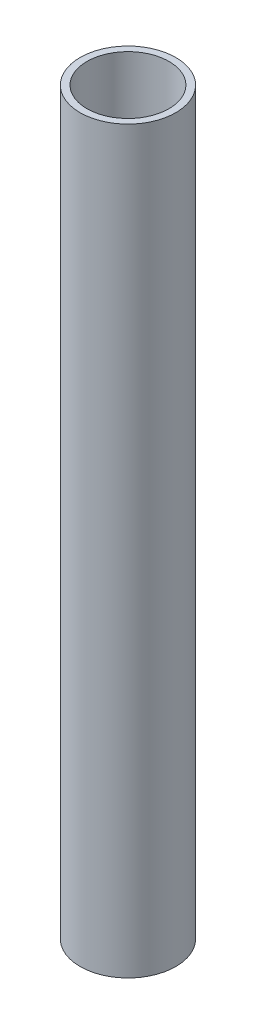
ISO-10303-21;
HEADER;
FILE_DESCRIPTION(('STEP AP214'),'2;1');
FILE_NAME('part.step','',(''),(''),'','','');
FILE_SCHEMA(('AUTOMOTIVE_DESIGN { 1 0 10303 214 1 1 1 1 }'));
ENDSEC;
DATA;
#1=APPLICATION_CONTEXT('core data for automotive mechanical design processes');
#2=APPLICATION_PROTOCOL_DEFINITION('international standard','automotive_design',2000,#1);
#3=PRODUCT_CONTEXT('',#1,'mechanical');
#4=PRODUCT('Part','Part','',(#3));
#5=PRODUCT_RELATED_PRODUCT_CATEGORY('part','',(#4));
#6=PRODUCT_DEFINITION_FORMATION('','',#4);
#7=PRODUCT_DEFINITION_CONTEXT('part definition',#1,'design');
#8=PRODUCT_DEFINITION('design','',#6,#7);
#9=PRODUCT_DEFINITION_SHAPE('','',#8);
#10=(LENGTH_UNIT() NAMED_UNIT(*) SI_UNIT(.MILLI.,.METRE.));
#11=(NAMED_UNIT(*) PLANE_ANGLE_UNIT() SI_UNIT($,.RADIAN.));
#12=(NAMED_UNIT(*) SI_UNIT($,.STERADIAN.) SOLID_ANGLE_UNIT());
#13=UNCERTAINTY_MEASURE_WITH_UNIT(LENGTH_MEASURE(1.E-05),#10,'distance_accuracy_value','');
#14=(GEOMETRIC_REPRESENTATION_CONTEXT(3) GLOBAL_UNCERTAINTY_ASSIGNED_CONTEXT((#13)) GLOBAL_UNIT_ASSIGNED_CONTEXT((#10,
#11,#12)) REPRESENTATION_CONTEXT('',''));
#15=CARTESIAN_POINT('',(0.,0.,0.));
#16=DIRECTION('',(0.,0.,1.));
#17=DIRECTION('',(1.,0.,0.));
#18=AXIS2_PLACEMENT_3D('',#15,#16,#17);
#19=CARTESIAN_POINT('',(0.,216.,0.));
#20=DIRECTION('',(0.,1.,0.));
#21=DIRECTION('',(0.,0.,1.));
#22=AXIS2_PLACEMENT_3D('',#19,#20,#21);
#23=PLANE('',#22);
#24=CARTESIAN_POINT('',(0.,216.,0.));
#25=DIRECTION('',(0.,1.,0.));
#26=DIRECTION('',(0.,0.,1.));
#27=AXIS2_PLACEMENT_3D('',#24,#25,#26);
#28=CIRCLE('',#27,13.975);
#29=CARTESIAN_POINT('',(0.,216.,13.975));
#30=VERTEX_POINT('',#29);
#31=EDGE_CURVE('E11',#30,#30,#28,.T.);
#32=ORIENTED_EDGE('',*,*,#31,.T.);
#33=EDGE_LOOP('',(#32));
#34=FACE_BOUND('',#33,.T.);
#35=CARTESIAN_POINT('',(0.,216.,0.));
#36=DIRECTION('',(0.,1.,0.));
#37=DIRECTION('',(0.,0.,1.));
#38=AXIS2_PLACEMENT_3D('',#35,#36,#37);
#39=CIRCLE('',#38,11.975);
#40=CARTESIAN_POINT('',(0.,216.,11.975));
#41=VERTEX_POINT('',#40);
#42=EDGE_CURVE('E49',#41,#41,#39,.T.);
#43=ORIENTED_EDGE('',*,*,#42,.F.);
#44=EDGE_LOOP('',(#43));
#45=FACE_BOUND('',#44,.T.);
#46=ADVANCED_FACE('F38',(#34,#45),#23,.T.);
#47=CARTESIAN_POINT('',(0.,0.,0.));
#48=DIRECTION('',(0.,1.,0.));
#49=DIRECTION('',(0.,0.,1.));
#50=AXIS2_PLACEMENT_3D('',#47,#48,#49);
#51=PLANE('',#50);
#52=CARTESIAN_POINT('',(0.,0.,0.));
#53=DIRECTION('',(0.,1.,0.));
#54=DIRECTION('',(0.,0.,1.));
#55=AXIS2_PLACEMENT_3D('',#52,#53,#54);
#56=CIRCLE('',#55,13.975);
#57=CARTESIAN_POINT('',(0.,0.,13.975));
#58=VERTEX_POINT('',#57);
#59=EDGE_CURVE('E42',#58,#58,#56,.T.);
#60=ORIENTED_EDGE('',*,*,#59,.F.);
#61=EDGE_LOOP('',(#60));
#62=FACE_BOUND('',#61,.T.);
#63=CARTESIAN_POINT('',(0.,0.,0.));
#64=DIRECTION('',(0.,1.,0.));
#65=DIRECTION('',(0.,0.,1.));
#66=AXIS2_PLACEMENT_3D('',#63,#64,#65);
#67=CIRCLE('',#66,11.975);
#68=CARTESIAN_POINT('',(0.,0.,11.975));
#69=VERTEX_POINT('',#68);
#70=EDGE_CURVE('E51',#69,#69,#67,.T.);
#71=ORIENTED_EDGE('',*,*,#70,.T.);
#72=EDGE_LOOP('',(#71));
#73=FACE_BOUND('',#72,.T.);
#74=ADVANCED_FACE('F61',(#62,#73),#51,.F.);
#75=CARTESIAN_POINT('',(0.,216.,0.));
#76=DIRECTION('',(0.,-1.,0.));
#77=DIRECTION('',(0.,0.,-1.));
#78=AXIS2_PLACEMENT_3D('',#75,#76,#77);
#79=CYLINDRICAL_SURFACE('',#78,13.975);
#80=ORIENTED_EDGE('',*,*,#31,.F.);
#81=EDGE_LOOP('',(#80));
#82=FACE_BOUND('',#81,.T.);
#83=ORIENTED_EDGE('',*,*,#59,.T.);
#84=EDGE_LOOP('',(#83));
#85=FACE_BOUND('',#84,.T.);
#86=ADVANCED_FACE('F40',(#82,#85),#79,.T.);
#87=CARTESIAN_POINT('',(0.,216.,0.));
#88=DIRECTION('',(0.,-1.,0.));
#89=DIRECTION('',(0.,0.,-1.));
#90=AXIS2_PLACEMENT_3D('',#87,#88,#89);
#91=CYLINDRICAL_SURFACE('',#90,11.975);
#92=ORIENTED_EDGE('',*,*,#42,.T.);
#93=EDGE_LOOP('',(#92));
#94=FACE_BOUND('',#93,.T.);
#95=ORIENTED_EDGE('',*,*,#70,.F.);
#96=EDGE_LOOP('',(#95));
#97=FACE_BOUND('',#96,.T.);
#98=ADVANCED_FACE('F57',(#94,#97),#91,.F.);
#99=CLOSED_SHELL('',(#46,#74,#86,#98));
#100=MANIFOLD_SOLID_BREP('B2',#99);
#101=ADVANCED_BREP_SHAPE_REPRESENTATION('',(#18,#100),#14);
#102=SHAPE_DEFINITION_REPRESENTATION(#9,#101);
ENDSEC;
END-ISO-10303-21;
